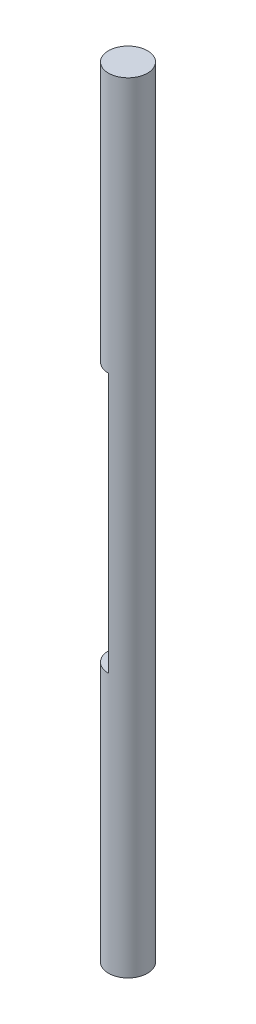
ISO-10303-21;
HEADER;
FILE_DESCRIPTION(('STEP AP214'),'2;1');
FILE_NAME('part.step','',(''),(''),'','','');
FILE_SCHEMA(('AUTOMOTIVE_DESIGN { 1 0 10303 214 1 1 1 1 }'));
ENDSEC;
DATA;
#1=APPLICATION_CONTEXT('core data for automotive mechanical design processes');
#2=APPLICATION_PROTOCOL_DEFINITION('international standard','automotive_design',2000,#1);
#3=PRODUCT_CONTEXT('',#1,'mechanical');
#4=PRODUCT('Part','Part','',(#3));
#5=PRODUCT_RELATED_PRODUCT_CATEGORY('part','',(#4));
#6=PRODUCT_DEFINITION_FORMATION('','',#4);
#7=PRODUCT_DEFINITION_CONTEXT('part definition',#1,'design');
#8=PRODUCT_DEFINITION('design','',#6,#7);
#9=PRODUCT_DEFINITION_SHAPE('','',#8);
#10=(LENGTH_UNIT() NAMED_UNIT(*) SI_UNIT(.MILLI.,.METRE.));
#11=(NAMED_UNIT(*) PLANE_ANGLE_UNIT() SI_UNIT($,.RADIAN.));
#12=(NAMED_UNIT(*) SI_UNIT($,.STERADIAN.) SOLID_ANGLE_UNIT());
#13=UNCERTAINTY_MEASURE_WITH_UNIT(LENGTH_MEASURE(1.E-05),#10,'distance_accuracy_value','');
#14=(GEOMETRIC_REPRESENTATION_CONTEXT(3) GLOBAL_UNCERTAINTY_ASSIGNED_CONTEXT((#13)) GLOBAL_UNIT_ASSIGNED_CONTEXT((#10,
#11,#12)) REPRESENTATION_CONTEXT('',''));
#15=CARTESIAN_POINT('',(0.,0.,0.));
#16=DIRECTION('',(0.,0.,1.));
#17=DIRECTION('',(1.,0.,0.));
#18=AXIS2_PLACEMENT_3D('',#15,#16,#17);
#19=CARTESIAN_POINT('',(0.,60.,0.));
#20=DIRECTION('',(0.,-1.,0.));
#21=DIRECTION('',(0.,0.,-1.));
#22=AXIS2_PLACEMENT_3D('',#19,#20,#21);
#23=CYLINDRICAL_SURFACE('',#22,1.5);
#24=CARTESIAN_POINT('',(0.,40.,0.));
#25=DIRECTION('',(0.,-1.,0.));
#26=DIRECTION('',(0.,0.,-1.));
#27=AXIS2_PLACEMENT_3D('',#24,#25,#26);
#28=CIRCLE('',#27,1.5);
#29=CARTESIAN_POINT('',(0.,40.,1.5));
#30=VERTEX_POINT('',#29);
#31=CARTESIAN_POINT('',(0.,40.,-1.5));
#32=VERTEX_POINT('',#31);
#33=EDGE_CURVE('E63',#30,#32,#28,.T.);
#34=ORIENTED_EDGE('',*,*,#33,.F.);
#35=DIRECTION('',(0.,-1.,0.));
#36=VECTOR('',#35,1.);
#37=CARTESIAN_POINT('',(0.,60.,1.5));
#38=LINE('',#37,#36);
#39=CARTESIAN_POINT('',(0.,20.,1.5));
#40=VERTEX_POINT('',#39);
#41=EDGE_CURVE('E11',#30,#40,#38,.T.);
#42=ORIENTED_EDGE('',*,*,#41,.T.);
#43=CARTESIAN_POINT('',(0.,20.,0.));
#44=DIRECTION('',(0.,-1.,0.));
#45=DIRECTION('',(0.,0.,-1.));
#46=AXIS2_PLACEMENT_3D('',#43,#44,#45);
#47=CIRCLE('',#46,1.5);
#48=CARTESIAN_POINT('',(0.,20.,-1.5));
#49=VERTEX_POINT('',#48);
#50=EDGE_CURVE('E38',#40,#49,#47,.T.);
#51=ORIENTED_EDGE('',*,*,#50,.T.);
#52=DIRECTION('',(0.,-1.,0.));
#53=VECTOR('',#52,1.);
#54=CARTESIAN_POINT('',(0.,60.,-1.5));
#55=LINE('',#54,#53);
#56=EDGE_CURVE('E50',#49,#32,#55,.F.);
#57=ORIENTED_EDGE('',*,*,#56,.T.);
#58=EDGE_LOOP('',(#34,#42,#51,#57));
#59=FACE_BOUND('',#58,.T.);
#60=CARTESIAN_POINT('',(0.,60.,0.));
#61=DIRECTION('',(0.,1.,0.));
#62=DIRECTION('',(0.,0.,1.));
#63=AXIS2_PLACEMENT_3D('',#60,#61,#62);
#64=CIRCLE('',#63,1.5);
#65=CARTESIAN_POINT('',(0.,60.,1.5));
#66=VERTEX_POINT('',#65);
#67=EDGE_CURVE('E67',#66,#66,#64,.T.);
#68=ORIENTED_EDGE('',*,*,#67,.F.);
#69=EDGE_LOOP('',(#68));
#70=FACE_BOUND('',#69,.T.);
#71=CARTESIAN_POINT('',(0.,0.,0.));
#72=DIRECTION('',(0.,1.,0.));
#73=DIRECTION('',(0.,0.,1.));
#74=AXIS2_PLACEMENT_3D('',#71,#72,#73);
#75=CIRCLE('',#74,1.5);
#76=CARTESIAN_POINT('',(0.,0.,1.5));
#77=VERTEX_POINT('',#76);
#78=EDGE_CURVE('E70',#77,#77,#75,.T.);
#79=ORIENTED_EDGE('',*,*,#78,.T.);
#80=EDGE_LOOP('',(#79));
#81=FACE_BOUND('',#80,.T.);
#82=ADVANCED_FACE('F31',(#59,#70,#81),#23,.T.);
#83=CARTESIAN_POINT('',(0.,60.,0.));
#84=DIRECTION('',(0.,1.,0.));
#85=DIRECTION('',(0.,0.,1.));
#86=AXIS2_PLACEMENT_3D('',#83,#84,#85);
#87=PLANE('',#86);
#88=ORIENTED_EDGE('',*,*,#67,.T.);
#89=EDGE_LOOP('',(#88));
#90=FACE_BOUND('',#89,.T.);
#91=ADVANCED_FACE('F85',(#90),#87,.T.);
#92=CARTESIAN_POINT('',(0.,0.,0.));
#93=DIRECTION('',(0.,1.,0.));
#94=DIRECTION('',(0.,0.,1.));
#95=AXIS2_PLACEMENT_3D('',#92,#93,#94);
#96=PLANE('',#95);
#97=ORIENTED_EDGE('',*,*,#78,.F.);
#98=EDGE_LOOP('',(#97));
#99=FACE_BOUND('',#98,.T.);
#100=ADVANCED_FACE('F78',(#99),#96,.F.);
#101=CARTESIAN_POINT('',(-40.,20.,-46.8104689145494));
#102=DIRECTION('',(0.,-1.,0.));
#103=DIRECTION('',(0.,0.,-1.));
#104=AXIS2_PLACEMENT_3D('',#101,#102,#103);
#105=PLANE('',#104);
#106=DIRECTION('',(0.,0.,-1.));
#107=VECTOR('',#106,1.);
#108=CARTESIAN_POINT('',(0.,20.,-46.8104689145494));
#109=LINE('',#108,#107);
#110=EDGE_CURVE('E57',#40,#49,#109,.T.);
#111=ORIENTED_EDGE('',*,*,#110,.T.);
#112=ORIENTED_EDGE('',*,*,#50,.F.);
#113=EDGE_LOOP('',(#111,#112));
#114=FACE_BOUND('',#113,.T.);
#115=ADVANCED_FACE('F76',(#114),#105,.F.);
#116=CARTESIAN_POINT('',(-40.,40.,-46.8104689145494));
#117=DIRECTION('',(0.,-1.,0.));
#118=DIRECTION('',(0.,0.,-1.));
#119=AXIS2_PLACEMENT_3D('',#116,#117,#118);
#120=PLANE('',#119);
#121=ORIENTED_EDGE('',*,*,#33,.T.);
#122=DIRECTION('',(0.,0.,-1.));
#123=VECTOR('',#122,1.);
#124=CARTESIAN_POINT('',(0.,40.,-46.8104689145494));
#125=LINE('',#124,#123);
#126=EDGE_CURVE('E45',#30,#32,#125,.T.);
#127=ORIENTED_EDGE('',*,*,#126,.F.);
#128=EDGE_LOOP('',(#121,#127));
#129=FACE_BOUND('',#128,.T.);
#130=ADVANCED_FACE('F62',(#129),#120,.T.);
#131=CARTESIAN_POINT('',(0.,30.,-46.8104689145494));
#132=DIRECTION('',(1.,0.,0.));
#133=DIRECTION('',(0.,0.,-1.));
#134=AXIS2_PLACEMENT_3D('',#131,#132,#133);
#135=PLANE('',#134);
#136=ORIENTED_EDGE('',*,*,#126,.T.);
#137=ORIENTED_EDGE('',*,*,#56,.F.);
#138=ORIENTED_EDGE('',*,*,#110,.F.);
#139=ORIENTED_EDGE('',*,*,#41,.F.);
#140=EDGE_LOOP('',(#136,#137,#138,#139));
#141=FACE_BOUND('',#140,.T.);
#142=ADVANCED_FACE('F56',(#141),#135,.F.);
#143=CLOSED_SHELL('',(#82,#91,#100,#115,#130,#142));
#144=MANIFOLD_SOLID_BREP('B2',#143);
#145=ADVANCED_BREP_SHAPE_REPRESENTATION('',(#18,#144),#14);
#146=SHAPE_DEFINITION_REPRESENTATION(#9,#145);
ENDSEC;
END-ISO-10303-21;
